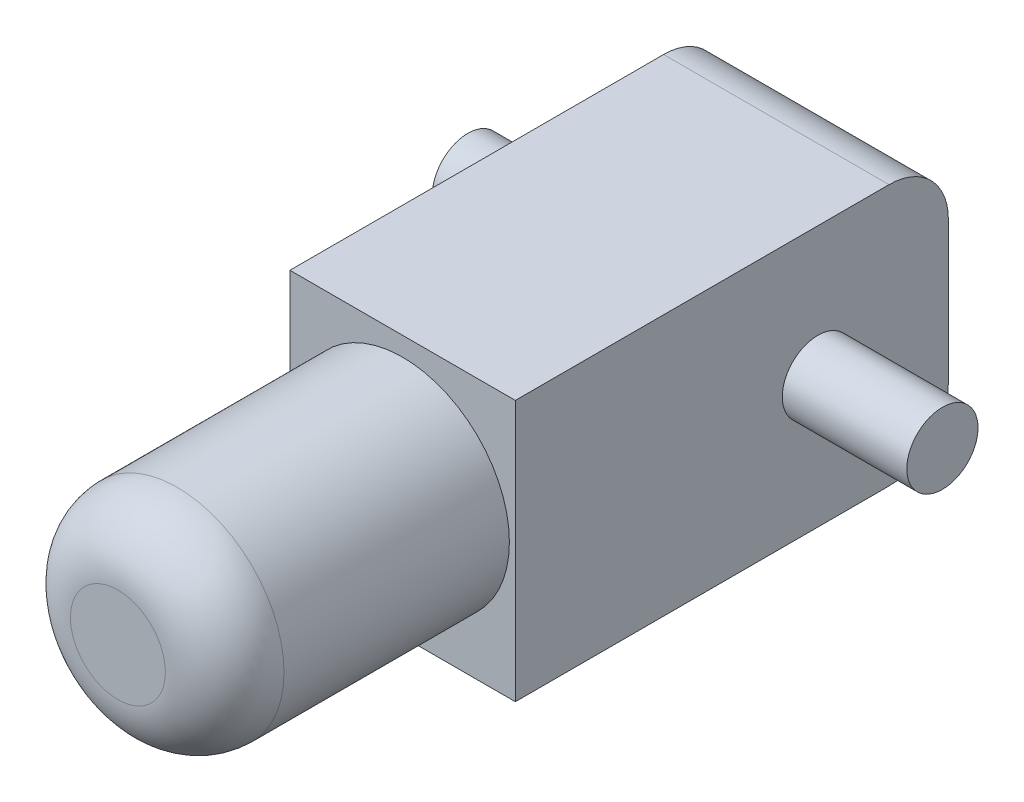
ISO-10303-21;
HEADER;
FILE_DESCRIPTION(('STEP AP214'),'2;1');
FILE_NAME('part.step','',(''),(''),'','','');
FILE_SCHEMA(('AUTOMOTIVE_DESIGN { 1 0 10303 214 1 1 1 1 }'));
ENDSEC;
DATA;
#1=APPLICATION_CONTEXT('core data for automotive mechanical design processes');
#2=APPLICATION_PROTOCOL_DEFINITION('international standard','automotive_design',2000,#1);
#3=PRODUCT_CONTEXT('',#1,'mechanical');
#4=PRODUCT('Part','Part','',(#3));
#5=PRODUCT_RELATED_PRODUCT_CATEGORY('part','',(#4));
#6=PRODUCT_DEFINITION_FORMATION('','',#4);
#7=PRODUCT_DEFINITION_CONTEXT('part definition',#1,'design');
#8=PRODUCT_DEFINITION('design','',#6,#7);
#9=PRODUCT_DEFINITION_SHAPE('','',#8);
#10=(LENGTH_UNIT() NAMED_UNIT(*) SI_UNIT(.MILLI.,.METRE.));
#11=(NAMED_UNIT(*) PLANE_ANGLE_UNIT() SI_UNIT($,.RADIAN.));
#12=(NAMED_UNIT(*) SI_UNIT($,.STERADIAN.) SOLID_ANGLE_UNIT());
#13=UNCERTAINTY_MEASURE_WITH_UNIT(LENGTH_MEASURE(1.E-05),#10,'distance_accuracy_value','');
#14=(GEOMETRIC_REPRESENTATION_CONTEXT(3) GLOBAL_UNCERTAINTY_ASSIGNED_CONTEXT((#13)) GLOBAL_UNIT_ASSIGNED_CONTEXT((#10,
#11,#12)) REPRESENTATION_CONTEXT('',''));
#15=CARTESIAN_POINT('',(0.,0.,0.));
#16=DIRECTION('',(0.,0.,1.));
#17=DIRECTION('',(1.,0.,0.));
#18=AXIS2_PLACEMENT_3D('',#15,#16,#17);
#19=CARTESIAN_POINT('',(19.,0.,0.));
#20=DIRECTION('',(0.,0.,-1.));
#21=DIRECTION('',(-1.,0.,0.));
#22=AXIS2_PLACEMENT_3D('',#19,#20,#21);
#23=PLANE('',#22);
#24=CARTESIAN_POINT('',(9.5,11.4055330562035,0.));
#25=DIRECTION('',(0.,0.,1.));
#26=DIRECTION('',(1.,0.,0.));
#27=AXIS2_PLACEMENT_3D('',#24,#25,#26);
#28=CIRCLE('',#27,9.);
#29=CARTESIAN_POINT('',(18.5,11.4055330562035,0.));
#30=VERTEX_POINT('',#29);
#31=EDGE_CURVE('E160',#30,#30,#28,.T.);
#32=ORIENTED_EDGE('',*,*,#31,.F.);
#33=EDGE_LOOP('',(#32));
#34=FACE_BOUND('',#33,.T.);
#35=DIRECTION('',(0.,-1.,0.));
#36=VECTOR('',#35,1.);
#37=CARTESIAN_POINT('',(0.,0.,0.));
#38=LINE('',#37,#36);
#39=CARTESIAN_POINT('',(0.,22.,0.));
#40=VERTEX_POINT('',#39);
#41=CARTESIAN_POINT('',(0.,0.,0.));
#42=VERTEX_POINT('',#41);
#43=EDGE_CURVE('E120',#40,#42,#38,.T.);
#44=ORIENTED_EDGE('',*,*,#43,.T.);
#45=DIRECTION('',(-1.,0.,0.));
#46=VECTOR('',#45,1.);
#47=CARTESIAN_POINT('',(19.,0.,0.));
#48=LINE('',#47,#46);
#49=CARTESIAN_POINT('',(19.,0.,0.));
#50=VERTEX_POINT('',#49);
#51=EDGE_CURVE('E103',#50,#42,#48,.T.);
#52=ORIENTED_EDGE('',*,*,#51,.F.);
#53=DIRECTION('',(0.,-1.,0.));
#54=VECTOR('',#53,1.);
#55=CARTESIAN_POINT('',(19.,0.,0.));
#56=LINE('',#55,#54);
#57=CARTESIAN_POINT('',(19.,22.,0.));
#58=VERTEX_POINT('',#57);
#59=EDGE_CURVE('E108',#58,#50,#56,.T.);
#60=ORIENTED_EDGE('',*,*,#59,.F.);
#61=DIRECTION('',(-1.,0.,0.));
#62=VECTOR('',#61,1.);
#63=CARTESIAN_POINT('',(19.,22.,0.));
#64=LINE('',#63,#62);
#65=EDGE_CURVE('E123',#58,#40,#64,.T.);
#66=ORIENTED_EDGE('',*,*,#65,.T.);
#67=EDGE_LOOP('',(#44,#52,#60,#66));
#68=FACE_BOUND('',#67,.T.);
#69=ADVANCED_FACE('F45',(#34,#68),#23,.F.);
#70=CARTESIAN_POINT('',(19.,0.,0.));
#71=DIRECTION('',(0.,1.,0.));
#72=DIRECTION('',(0.,0.,1.));
#73=AXIS2_PLACEMENT_3D('',#70,#71,#72);
#74=PLANE('',#73);
#75=DIRECTION('',(0.,0.,-1.));
#76=VECTOR('',#75,1.);
#77=CARTESIAN_POINT('',(0.,0.,0.));
#78=LINE('',#77,#76);
#79=CARTESIAN_POINT('',(0.,0.,-31.5));
#80=VERTEX_POINT('',#79);
#81=EDGE_CURVE('E184',#42,#80,#78,.T.);
#82=ORIENTED_EDGE('',*,*,#81,.T.);
#83=DIRECTION('',(-1.,0.,0.));
#84=VECTOR('',#83,1.);
#85=CARTESIAN_POINT('',(19.,0.,-31.5));
#86=LINE('',#85,#84);
#87=CARTESIAN_POINT('',(19.,0.,-31.5));
#88=VERTEX_POINT('',#87);
#89=EDGE_CURVE('E69',#80,#88,#86,.F.);
#90=ORIENTED_EDGE('',*,*,#89,.T.);
#91=DIRECTION('',(0.,0.,-1.));
#92=VECTOR('',#91,1.);
#93=CARTESIAN_POINT('',(19.,0.,0.));
#94=LINE('',#93,#92);
#95=EDGE_CURVE('E99',#50,#88,#94,.T.);
#96=ORIENTED_EDGE('',*,*,#95,.F.);
#97=ORIENTED_EDGE('',*,*,#51,.T.);
#98=EDGE_LOOP('',(#82,#90,#96,#97));
#99=FACE_BOUND('',#98,.T.);
#100=ADVANCED_FACE('F101',(#99),#74,.F.);
#101=CARTESIAN_POINT('',(19.,0.,-36.5));
#102=DIRECTION('',(0.,0.,1.));
#103=DIRECTION('',(0.,-1.,0.));
#104=AXIS2_PLACEMENT_3D('',#101,#102,#103);
#105=PLANE('',#104);
#106=DIRECTION('',(0.,1.,0.));
#107=VECTOR('',#106,1.);
#108=CARTESIAN_POINT('',(19.,0.,-36.5));
#109=LINE('',#108,#107);
#110=CARTESIAN_POINT('',(19.,5.,-36.5));
#111=VERTEX_POINT('',#110);
#112=CARTESIAN_POINT('',(19.,17.,-36.5));
#113=VERTEX_POINT('',#112);
#114=EDGE_CURVE('E107',#111,#113,#109,.T.);
#115=ORIENTED_EDGE('',*,*,#114,.F.);
#116=DIRECTION('',(-1.,0.,0.));
#117=VECTOR('',#116,1.);
#118=CARTESIAN_POINT('',(19.,5.,-36.5));
#119=LINE('',#118,#117);
#120=CARTESIAN_POINT('',(0.,5.,-36.5));
#121=VERTEX_POINT('',#120);
#122=EDGE_CURVE('E140',#111,#121,#119,.T.);
#123=ORIENTED_EDGE('',*,*,#122,.T.);
#124=DIRECTION('',(0.,1.,0.));
#125=VECTOR('',#124,1.);
#126=CARTESIAN_POINT('',(0.,0.,-36.5));
#127=LINE('',#126,#125);
#128=CARTESIAN_POINT('',(0.,17.,-36.5));
#129=VERTEX_POINT('',#128);
#130=EDGE_CURVE('E187',#121,#129,#127,.T.);
#131=ORIENTED_EDGE('',*,*,#130,.T.);
#132=DIRECTION('',(-1.,0.,0.));
#133=VECTOR('',#132,1.);
#134=CARTESIAN_POINT('',(19.,17.,-36.5));
#135=LINE('',#134,#133);
#136=EDGE_CURVE('E128',#129,#113,#135,.F.);
#137=ORIENTED_EDGE('',*,*,#136,.T.);
#138=EDGE_LOOP('',(#115,#123,#131,#137));
#139=FACE_BOUND('',#138,.T.);
#140=ADVANCED_FACE('F203',(#139),#105,.F.);
#141=CARTESIAN_POINT('',(19.,22.,0.));
#142=DIRECTION('',(0.,-1.,0.));
#143=DIRECTION('',(0.,0.,-1.));
#144=AXIS2_PLACEMENT_3D('',#141,#142,#143);
#145=PLANE('',#144);
#146=DIRECTION('',(0.,0.,1.));
#147=VECTOR('',#146,1.);
#148=CARTESIAN_POINT('',(19.,22.,0.));
#149=LINE('',#148,#147);
#150=CARTESIAN_POINT('',(19.,22.,-31.5));
#151=VERTEX_POINT('',#150);
#152=EDGE_CURVE('E112',#151,#58,#149,.T.);
#153=ORIENTED_EDGE('',*,*,#152,.F.);
#154=DIRECTION('',(-1.,0.,0.));
#155=VECTOR('',#154,1.);
#156=CARTESIAN_POINT('',(19.,22.,-31.5));
#157=LINE('',#156,#155);
#158=CARTESIAN_POINT('',(0.,22.,-31.5));
#159=VERTEX_POINT('',#158);
#160=EDGE_CURVE('E157',#151,#159,#157,.T.);
#161=ORIENTED_EDGE('',*,*,#160,.T.);
#162=DIRECTION('',(0.,0.,1.));
#163=VECTOR('',#162,1.);
#164=CARTESIAN_POINT('',(0.,22.,0.));
#165=LINE('',#164,#163);
#166=EDGE_CURVE('E117',#159,#40,#165,.T.);
#167=ORIENTED_EDGE('',*,*,#166,.T.);
#168=ORIENTED_EDGE('',*,*,#65,.F.);
#169=EDGE_LOOP('',(#153,#161,#167,#168));
#170=FACE_BOUND('',#169,.T.);
#171=ADVANCED_FACE('F193',(#170),#145,.F.);
#172=CARTESIAN_POINT('',(19.,0.,0.));
#173=DIRECTION('',(-1.,0.,0.));
#174=DIRECTION('',(0.,0.,1.));
#175=AXIS2_PLACEMENT_3D('',#172,#173,#174);
#176=PLANE('',#175);
#177=CARTESIAN_POINT('',(19.,11.,-25.5));
#178=DIRECTION('',(-1.,0.,0.));
#179=DIRECTION('',(0.,0.,1.));
#180=AXIS2_PLACEMENT_3D('',#177,#178,#179);
#181=CIRCLE('',#180,3.);
#182=CARTESIAN_POINT('',(19.,11.,-22.5));
#183=VERTEX_POINT('',#182);
#184=EDGE_CURVE('E122',#183,#183,#181,.F.);
#185=ORIENTED_EDGE('',*,*,#184,.F.);
#186=EDGE_LOOP('',(#185));
#187=FACE_BOUND('',#186,.T.);
#188=ORIENTED_EDGE('',*,*,#95,.T.);
#189=CARTESIAN_POINT('',(19.,5.,-31.5));
#190=DIRECTION('',(-1.,0.,0.));
#191=DIRECTION('',(0.,0.,1.));
#192=AXIS2_PLACEMENT_3D('',#189,#190,#191);
#193=CIRCLE('',#192,5.);
#194=EDGE_CURVE('E154',#88,#111,#193,.F.);
#195=ORIENTED_EDGE('',*,*,#194,.T.);
#196=ORIENTED_EDGE('',*,*,#114,.T.);
#197=CARTESIAN_POINT('',(19.,17.,-31.5));
#198=DIRECTION('',(-1.,0.,0.));
#199=DIRECTION('',(0.,0.,1.));
#200=AXIS2_PLACEMENT_3D('',#197,#198,#199);
#201=CIRCLE('',#200,5.);
#202=EDGE_CURVE('E61',#113,#151,#201,.F.);
#203=ORIENTED_EDGE('',*,*,#202,.T.);
#204=ORIENTED_EDGE('',*,*,#152,.T.);
#205=ORIENTED_EDGE('',*,*,#59,.T.);
#206=EDGE_LOOP('',(#188,#195,#196,#203,#204,#205));
#207=FACE_BOUND('',#206,.T.);
#208=ADVANCED_FACE('F111',(#187,#207),#176,.F.);
#209=CARTESIAN_POINT('',(0.,0.,0.));
#210=DIRECTION('',(-1.,0.,0.));
#211=DIRECTION('',(0.,0.,1.));
#212=AXIS2_PLACEMENT_3D('',#209,#210,#211);
#213=PLANE('',#212);
#214=CARTESIAN_POINT('',(0.,11.,-25.5));
#215=DIRECTION('',(-1.,0.,0.));
#216=DIRECTION('',(0.,0.,1.));
#217=AXIS2_PLACEMENT_3D('',#214,#215,#216);
#218=CIRCLE('',#217,3.);
#219=CARTESIAN_POINT('',(0.,11.,-22.5));
#220=VERTEX_POINT('',#219);
#221=EDGE_CURVE('E133',#220,#220,#218,.F.);
#222=ORIENTED_EDGE('',*,*,#221,.T.);
#223=EDGE_LOOP('',(#222));
#224=FACE_BOUND('',#223,.T.);
#225=ORIENTED_EDGE('',*,*,#130,.F.);
#226=CARTESIAN_POINT('',(0.,5.,-31.5));
#227=DIRECTION('',(-1.,0.,0.));
#228=DIRECTION('',(0.,0.,1.));
#229=AXIS2_PLACEMENT_3D('',#226,#227,#228);
#230=CIRCLE('',#229,5.);
#231=EDGE_CURVE('E147',#121,#80,#230,.T.);
#232=ORIENTED_EDGE('',*,*,#231,.T.);
#233=ORIENTED_EDGE('',*,*,#81,.F.);
#234=ORIENTED_EDGE('',*,*,#43,.F.);
#235=ORIENTED_EDGE('',*,*,#166,.F.);
#236=CARTESIAN_POINT('',(0.,17.,-31.5));
#237=DIRECTION('',(-1.,0.,0.));
#238=DIRECTION('',(0.,0.,1.));
#239=AXIS2_PLACEMENT_3D('',#236,#237,#238);
#240=CIRCLE('',#239,5.);
#241=EDGE_CURVE('E144',#159,#129,#240,.T.);
#242=ORIENTED_EDGE('',*,*,#241,.T.);
#243=EDGE_LOOP('',(#225,#232,#233,#234,#235,#242));
#244=FACE_BOUND('',#243,.T.);
#245=ADVANCED_FACE('F197',(#224,#244),#213,.T.);
#246=CARTESIAN_POINT('',(-10.5,11.,-25.5));
#247=DIRECTION('',(1.,0.,0.));
#248=DIRECTION('',(0.,0.,-1.));
#249=AXIS2_PLACEMENT_3D('',#246,#247,#248);
#250=PLANE('',#249);
#251=CARTESIAN_POINT('',(-10.5,11.,-25.5));
#252=DIRECTION('',(1.,0.,0.));
#253=DIRECTION('',(0.,0.,-1.));
#254=AXIS2_PLACEMENT_3D('',#251,#252,#253);
#255=CIRCLE('',#254,3.);
#256=CARTESIAN_POINT('',(-10.5,11.,-28.5));
#257=VERTEX_POINT('',#256);
#258=EDGE_CURVE('E174',#257,#257,#255,.T.);
#259=ORIENTED_EDGE('',*,*,#258,.F.);
#260=EDGE_LOOP('',(#259));
#261=FACE_BOUND('',#260,.T.);
#262=ADVANCED_FACE('F232',(#261),#250,.F.);
#263=CARTESIAN_POINT('',(29.5,11.,-25.5));
#264=DIRECTION('',(-1.,0.,0.));
#265=DIRECTION('',(0.,0.,1.));
#266=AXIS2_PLACEMENT_3D('',#263,#264,#265);
#267=CYLINDRICAL_SURFACE('',#266,3.);
#268=ORIENTED_EDGE('',*,*,#221,.F.);
#269=EDGE_LOOP('',(#268));
#270=FACE_BOUND('',#269,.T.);
#271=ORIENTED_EDGE('',*,*,#258,.T.);
#272=EDGE_LOOP('',(#271));
#273=FACE_BOUND('',#272,.T.);
#274=ADVANCED_FACE('F237',(#270,#273),#267,.T.);
#275=CARTESIAN_POINT('',(29.5,11.,-25.5));
#276=DIRECTION('',(1.,0.,0.));
#277=DIRECTION('',(0.,0.,-1.));
#278=AXIS2_PLACEMENT_3D('',#275,#276,#277);
#279=CIRCLE('',#278,3.);
#280=CARTESIAN_POINT('',(29.5,11.,-28.5));
#281=VERTEX_POINT('',#280);
#282=EDGE_CURVE('E137',#281,#281,#279,.T.);
#283=ORIENTED_EDGE('',*,*,#282,.F.);
#284=EDGE_LOOP('',(#283));
#285=FACE_BOUND('',#284,.T.);
#286=ORIENTED_EDGE('',*,*,#184,.T.);
#287=EDGE_LOOP('',(#286));
#288=FACE_BOUND('',#287,.T.);
#289=ADVANCED_FACE('F240',(#285,#288),#267,.T.);
#290=CARTESIAN_POINT('',(29.5,11.,-25.5));
#291=DIRECTION('',(1.,0.,0.));
#292=DIRECTION('',(0.,0.,-1.));
#293=AXIS2_PLACEMENT_3D('',#290,#291,#292);
#294=PLANE('',#293);
#295=ORIENTED_EDGE('',*,*,#282,.T.);
#296=EDGE_LOOP('',(#295));
#297=FACE_BOUND('',#296,.T.);
#298=ADVANCED_FACE('F216',(#297),#294,.T.);
#299=CARTESIAN_POINT('',(19.,5.,-31.5));
#300=DIRECTION('',(-1.,0.,0.));
#301=DIRECTION('',(0.,0.,1.));
#302=AXIS2_PLACEMENT_3D('',#299,#300,#301);
#303=CYLINDRICAL_SURFACE('',#302,5.);
#304=ORIENTED_EDGE('',*,*,#194,.F.);
#305=ORIENTED_EDGE('',*,*,#89,.F.);
#306=ORIENTED_EDGE('',*,*,#231,.F.);
#307=ORIENTED_EDGE('',*,*,#122,.F.);
#308=EDGE_LOOP('',(#304,#305,#306,#307));
#309=FACE_BOUND('',#308,.T.);
#310=ADVANCED_FACE('F199',(#309),#303,.T.);
#311=CARTESIAN_POINT('',(19.,17.,-31.5));
#312=DIRECTION('',(-1.,0.,0.));
#313=DIRECTION('',(0.,0.,1.));
#314=AXIS2_PLACEMENT_3D('',#311,#312,#313);
#315=CYLINDRICAL_SURFACE('',#314,5.);
#316=ORIENTED_EDGE('',*,*,#202,.F.);
#317=ORIENTED_EDGE('',*,*,#136,.F.);
#318=ORIENTED_EDGE('',*,*,#241,.F.);
#319=ORIENTED_EDGE('',*,*,#160,.F.);
#320=EDGE_LOOP('',(#316,#317,#318,#319));
#321=FACE_BOUND('',#320,.T.);
#322=ADVANCED_FACE('F206',(#321),#315,.T.);
#323=CARTESIAN_POINT('',(9.5,11.4055330562035,24.));
#324=DIRECTION('',(0.,0.,-1.));
#325=DIRECTION('',(-1.,0.,0.));
#326=AXIS2_PLACEMENT_3D('',#323,#324,#325);
#327=CYLINDRICAL_SURFACE('',#326,9.);
#328=CARTESIAN_POINT('',(9.5,11.4055330562035,19.));
#329=DIRECTION('',(0.,0.,1.));
#330=DIRECTION('',(1.,0.,0.));
#331=AXIS2_PLACEMENT_3D('',#328,#329,#330);
#332=CIRCLE('',#331,9.);
#333=CARTESIAN_POINT('',(18.5,11.4055330562035,19.));
#334=VERTEX_POINT('',#333);
#335=EDGE_CURVE('E11',#334,#334,#332,.F.);
#336=ORIENTED_EDGE('',*,*,#335,.T.);
#337=EDGE_LOOP('',(#336));
#338=FACE_BOUND('',#337,.T.);
#339=ORIENTED_EDGE('',*,*,#31,.T.);
#340=EDGE_LOOP('',(#339));
#341=FACE_BOUND('',#340,.T.);
#342=ADVANCED_FACE('F208',(#338,#341),#327,.T.);
#343=CARTESIAN_POINT('',(9.5,11.4055330562035,24.));
#344=DIRECTION('',(0.,0.,1.));
#345=DIRECTION('',(1.,0.,0.));
#346=AXIS2_PLACEMENT_3D('',#343,#344,#345);
#347=PLANE('',#346);
#348=CARTESIAN_POINT('',(9.5,11.4055330562035,24.));
#349=DIRECTION('',(0.,0.,1.));
#350=DIRECTION('',(1.,0.,0.));
#351=AXIS2_PLACEMENT_3D('',#348,#349,#350);
#352=CIRCLE('',#351,4.);
#353=CARTESIAN_POINT('',(13.5,11.4055330562035,24.));
#354=VERTEX_POINT('',#353);
#355=EDGE_CURVE('E54',#354,#354,#352,.T.);
#356=ORIENTED_EDGE('',*,*,#355,.T.);
#357=EDGE_LOOP('',(#356));
#358=FACE_BOUND('',#357,.T.);
#359=ADVANCED_FACE('F213',(#358),#347,.T.);
#360=CARTESIAN_POINT('',(9.5,11.4055330562035,19.));
#361=DIRECTION('',(0.,0.,1.));
#362=DIRECTION('',(1.,0.,0.));
#363=AXIS2_PLACEMENT_3D('',#360,#361,#362);
#364=DEGENERATE_TOROIDAL_SURFACE('',#363,4.,5.,.T.);
#365=ORIENTED_EDGE('',*,*,#335,.F.);
#366=EDGE_LOOP('',(#365));
#367=FACE_BOUND('',#366,.T.);
#368=ORIENTED_EDGE('',*,*,#355,.F.);
#369=EDGE_LOOP('',(#368));
#370=FACE_BOUND('',#369,.T.);
#371=ADVANCED_FACE('F47',(#367,#370),#364,.T.);
#372=CLOSED_SHELL('',(#69,#100,#140,#171,#208,#245,#262,#274,#289,#298,#310,#322,#342,#359,#371));
#373=MANIFOLD_SOLID_BREP('B2',#372);
#374=ADVANCED_BREP_SHAPE_REPRESENTATION('',(#18,#373),#14);
#375=SHAPE_DEFINITION_REPRESENTATION(#9,#374);
ENDSEC;
END-ISO-10303-21;
